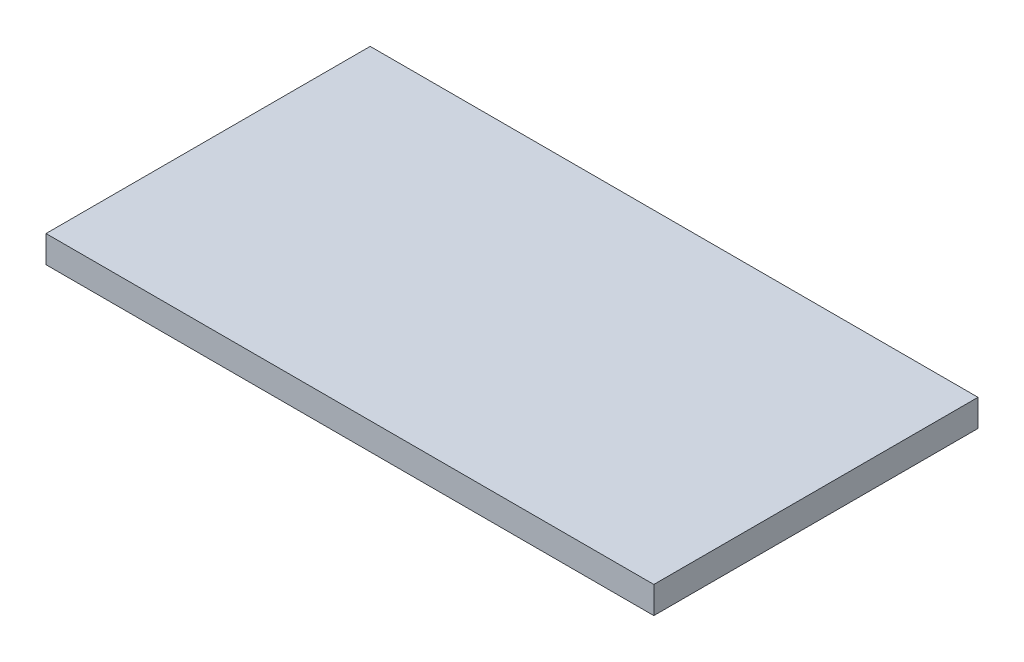
ISO-10303-21;
HEADER;
FILE_DESCRIPTION(('STEP AP214'),'2;1');
FILE_NAME('part.step','',(''),(''),'','','');
FILE_SCHEMA(('AUTOMOTIVE_DESIGN { 1 0 10303 214 1 1 1 1 }'));
ENDSEC;
DATA;
#1=APPLICATION_CONTEXT('core data for automotive mechanical design processes');
#2=APPLICATION_PROTOCOL_DEFINITION('international standard','automotive_design',2000,#1);
#3=PRODUCT_CONTEXT('',#1,'mechanical');
#4=PRODUCT('Part','Part','',(#3));
#5=PRODUCT_RELATED_PRODUCT_CATEGORY('part','',(#4));
#6=PRODUCT_DEFINITION_FORMATION('','',#4);
#7=PRODUCT_DEFINITION_CONTEXT('part definition',#1,'design');
#8=PRODUCT_DEFINITION('design','',#6,#7);
#9=PRODUCT_DEFINITION_SHAPE('','',#8);
#10=(LENGTH_UNIT() NAMED_UNIT(*) SI_UNIT(.MILLI.,.METRE.));
#11=(NAMED_UNIT(*) PLANE_ANGLE_UNIT() SI_UNIT($,.RADIAN.));
#12=(NAMED_UNIT(*) SI_UNIT($,.STERADIAN.) SOLID_ANGLE_UNIT());
#13=UNCERTAINTY_MEASURE_WITH_UNIT(LENGTH_MEASURE(1.E-05),#10,'distance_accuracy_value','');
#14=(GEOMETRIC_REPRESENTATION_CONTEXT(3) GLOBAL_UNCERTAINTY_ASSIGNED_CONTEXT((#13)) GLOBAL_UNIT_ASSIGNED_CONTEXT((#10,
#11,#12)) REPRESENTATION_CONTEXT('',''));
#15=CARTESIAN_POINT('',(0.,0.,0.));
#16=DIRECTION('',(0.,0.,1.));
#17=DIRECTION('',(1.,0.,0.));
#18=AXIS2_PLACEMENT_3D('',#15,#16,#17);
#19=CARTESIAN_POINT('',(-112.5,15.,60.));
#20=DIRECTION('',(-1.,0.,0.));
#21=DIRECTION('',(0.,0.,1.));
#22=AXIS2_PLACEMENT_3D('',#19,#20,#21);
#23=PLANE('',#22);
#24=DIRECTION('',(0.,0.,1.));
#25=VECTOR('',#24,1.);
#26=CARTESIAN_POINT('',(-112.5,0.,60.));
#27=LINE('',#26,#25);
#28=CARTESIAN_POINT('',(-112.5,0.,-60.));
#29=VERTEX_POINT('',#28);
#30=CARTESIAN_POINT('',(-112.5,0.,60.));
#31=VERTEX_POINT('',#30);
#32=EDGE_CURVE('E43',#29,#31,#27,.T.);
#33=ORIENTED_EDGE('',*,*,#32,.F.);
#34=DIRECTION('',(0.,-1.,0.));
#35=VECTOR('',#34,1.);
#36=CARTESIAN_POINT('',(-112.5,15.,-60.));
#37=LINE('',#36,#35);
#38=CARTESIAN_POINT('',(-112.5,-10.,-60.));
#39=VERTEX_POINT('',#38);
#40=EDGE_CURVE('E71',#29,#39,#37,.T.);
#41=ORIENTED_EDGE('',*,*,#40,.T.);
#42=DIRECTION('',(0.,0.,-1.));
#43=VECTOR('',#42,1.);
#44=CARTESIAN_POINT('',(-112.5,-10.,60.));
#45=LINE('',#44,#43);
#46=CARTESIAN_POINT('',(-112.5,-10.,60.));
#47=VERTEX_POINT('',#46);
#48=EDGE_CURVE('E75',#47,#39,#45,.T.);
#49=ORIENTED_EDGE('',*,*,#48,.F.);
#50=DIRECTION('',(0.,-1.,0.));
#51=VECTOR('',#50,1.);
#52=CARTESIAN_POINT('',(-112.5,15.,60.));
#53=LINE('',#52,#51);
#54=EDGE_CURVE('E98',#31,#47,#53,.T.);
#55=ORIENTED_EDGE('',*,*,#54,.F.);
#56=EDGE_LOOP('',(#33,#41,#49,#55));
#57=FACE_BOUND('',#56,.T.);
#58=ADVANCED_FACE('F35',(#57),#23,.T.);
#59=CARTESIAN_POINT('',(112.5,15.,60.));
#60=DIRECTION('',(0.,0.,1.));
#61=DIRECTION('',(1.,0.,0.));
#62=AXIS2_PLACEMENT_3D('',#59,#60,#61);
#63=PLANE('',#62);
#64=DIRECTION('',(1.,0.,0.));
#65=VECTOR('',#64,1.);
#66=CARTESIAN_POINT('',(112.5,0.,60.));
#67=LINE('',#66,#65);
#68=CARTESIAN_POINT('',(112.5,0.,60.));
#69=VERTEX_POINT('',#68);
#70=EDGE_CURVE('E50',#31,#69,#67,.T.);
#71=ORIENTED_EDGE('',*,*,#70,.F.);
#72=ORIENTED_EDGE('',*,*,#54,.T.);
#73=DIRECTION('',(-1.,0.,0.));
#74=VECTOR('',#73,1.);
#75=CARTESIAN_POINT('',(112.5,-10.,60.));
#76=LINE('',#75,#74);
#77=CARTESIAN_POINT('',(112.5,-10.,60.));
#78=VERTEX_POINT('',#77);
#79=EDGE_CURVE('E80',#78,#47,#76,.T.);
#80=ORIENTED_EDGE('',*,*,#79,.F.);
#81=DIRECTION('',(0.,-1.,0.));
#82=VECTOR('',#81,1.);
#83=CARTESIAN_POINT('',(112.5,15.,60.));
#84=LINE('',#83,#82);
#85=EDGE_CURVE('E101',#69,#78,#84,.T.);
#86=ORIENTED_EDGE('',*,*,#85,.F.);
#87=EDGE_LOOP('',(#71,#72,#80,#86));
#88=FACE_BOUND('',#87,.T.);
#89=ADVANCED_FACE('F107',(#88),#63,.T.);
#90=CARTESIAN_POINT('',(112.5,15.,60.));
#91=DIRECTION('',(1.,0.,0.));
#92=DIRECTION('',(0.,0.,-1.));
#93=AXIS2_PLACEMENT_3D('',#90,#91,#92);
#94=PLANE('',#93);
#95=DIRECTION('',(0.,0.,-1.));
#96=VECTOR('',#95,1.);
#97=CARTESIAN_POINT('',(112.5,0.,60.));
#98=LINE('',#97,#96);
#99=CARTESIAN_POINT('',(112.5,0.,-60.));
#100=VERTEX_POINT('',#99);
#101=EDGE_CURVE('E100',#69,#100,#98,.T.);
#102=ORIENTED_EDGE('',*,*,#101,.F.);
#103=ORIENTED_EDGE('',*,*,#85,.T.);
#104=DIRECTION('',(0.,0.,1.));
#105=VECTOR('',#104,1.);
#106=CARTESIAN_POINT('',(112.5,-10.,60.));
#107=LINE('',#106,#105);
#108=CARTESIAN_POINT('',(112.5,-10.,-60.));
#109=VERTEX_POINT('',#108);
#110=EDGE_CURVE('E88',#109,#78,#107,.T.);
#111=ORIENTED_EDGE('',*,*,#110,.F.);
#112=DIRECTION('',(0.,-1.,0.));
#113=VECTOR('',#112,1.);
#114=CARTESIAN_POINT('',(112.5,15.,-60.));
#115=LINE('',#114,#113);
#116=EDGE_CURVE('E79',#100,#109,#115,.T.);
#117=ORIENTED_EDGE('',*,*,#116,.F.);
#118=EDGE_LOOP('',(#102,#103,#111,#117));
#119=FACE_BOUND('',#118,.T.);
#120=ADVANCED_FACE('F105',(#119),#94,.T.);
#121=CARTESIAN_POINT('',(112.5,15.,-60.));
#122=DIRECTION('',(0.,0.,-1.));
#123=DIRECTION('',(-1.,0.,0.));
#124=AXIS2_PLACEMENT_3D('',#121,#122,#123);
#125=PLANE('',#124);
#126=DIRECTION('',(-1.,0.,0.));
#127=VECTOR('',#126,1.);
#128=CARTESIAN_POINT('',(112.5,0.,-60.));
#129=LINE('',#128,#127);
#130=EDGE_CURVE('E11',#100,#29,#129,.T.);
#131=ORIENTED_EDGE('',*,*,#130,.F.);
#132=ORIENTED_EDGE('',*,*,#116,.T.);
#133=DIRECTION('',(1.,0.,0.));
#134=VECTOR('',#133,1.);
#135=CARTESIAN_POINT('',(112.5,-10.,-60.));
#136=LINE('',#135,#134);
#137=EDGE_CURVE('E82',#39,#109,#136,.T.);
#138=ORIENTED_EDGE('',*,*,#137,.F.);
#139=ORIENTED_EDGE('',*,*,#40,.F.);
#140=EDGE_LOOP('',(#131,#132,#138,#139));
#141=FACE_BOUND('',#140,.T.);
#142=ADVANCED_FACE('F83',(#141),#125,.T.);
#143=CARTESIAN_POINT('',(0.,-10.,0.));
#144=DIRECTION('',(0.,1.,0.));
#145=DIRECTION('',(0.,0.,1.));
#146=AXIS2_PLACEMENT_3D('',#143,#144,#145);
#147=PLANE('',#146);
#148=ORIENTED_EDGE('',*,*,#48,.T.);
#149=ORIENTED_EDGE('',*,*,#137,.T.);
#150=ORIENTED_EDGE('',*,*,#110,.T.);
#151=ORIENTED_EDGE('',*,*,#79,.T.);
#152=EDGE_LOOP('',(#148,#149,#150,#151));
#153=FACE_BOUND('',#152,.T.);
#154=ADVANCED_FACE('F90',(#153),#147,.F.);
#155=CARTESIAN_POINT('',(0.,0.,0.));
#156=DIRECTION('',(0.,-1.,0.));
#157=DIRECTION('',(0.,0.,-1.));
#158=AXIS2_PLACEMENT_3D('',#155,#156,#157);
#159=PLANE('',#158);
#160=ORIENTED_EDGE('',*,*,#32,.T.);
#161=ORIENTED_EDGE('',*,*,#70,.T.);
#162=ORIENTED_EDGE('',*,*,#101,.T.);
#163=ORIENTED_EDGE('',*,*,#130,.T.);
#164=EDGE_LOOP('',(#160,#161,#162,#163));
#165=FACE_BOUND('',#164,.T.);
#166=ADVANCED_FACE('F109',(#165),#159,.F.);
#167=CLOSED_SHELL('',(#58,#89,#120,#142,#154,#166));
#168=MANIFOLD_SOLID_BREP('B2',#167);
#169=ADVANCED_BREP_SHAPE_REPRESENTATION('',(#18,#168),#14);
#170=SHAPE_DEFINITION_REPRESENTATION(#9,#169);
ENDSEC;
END-ISO-10303-21;
